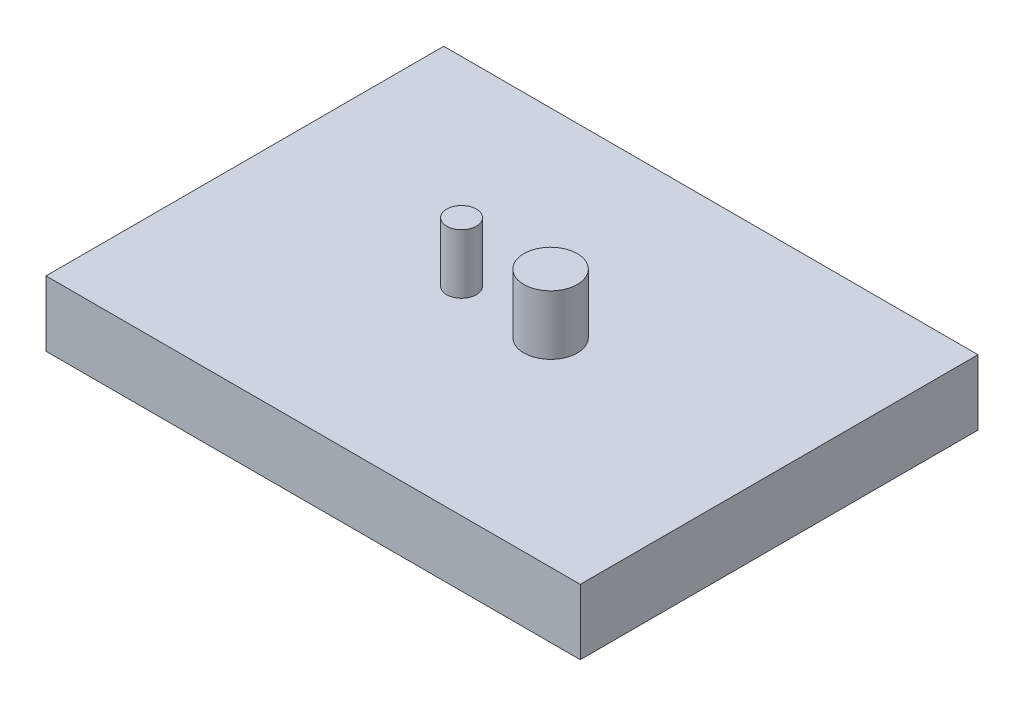
ISO-10303-21;
HEADER;
FILE_DESCRIPTION(('STEP AP214'),'2;1');
FILE_NAME('part.step','',(''),(''),'','','');
FILE_SCHEMA(('AUTOMOTIVE_DESIGN { 1 0 10303 214 1 1 1 1 }'));
ENDSEC;
DATA;
#1=APPLICATION_CONTEXT('core data for automotive mechanical design processes');
#2=APPLICATION_PROTOCOL_DEFINITION('international standard','automotive_design',2000,#1);
#3=PRODUCT_CONTEXT('',#1,'mechanical');
#4=PRODUCT('Part','Part','',(#3));
#5=PRODUCT_RELATED_PRODUCT_CATEGORY('part','',(#4));
#6=PRODUCT_DEFINITION_FORMATION('','',#4);
#7=PRODUCT_DEFINITION_CONTEXT('part definition',#1,'design');
#8=PRODUCT_DEFINITION('design','',#6,#7);
#9=PRODUCT_DEFINITION_SHAPE('','',#8);
#10=(LENGTH_UNIT() NAMED_UNIT(*) SI_UNIT(.MILLI.,.METRE.));
#11=(NAMED_UNIT(*) PLANE_ANGLE_UNIT() SI_UNIT($,.RADIAN.));
#12=(NAMED_UNIT(*) SI_UNIT($,.STERADIAN.) SOLID_ANGLE_UNIT());
#13=UNCERTAINTY_MEASURE_WITH_UNIT(LENGTH_MEASURE(1.E-05),#10,'distance_accuracy_value','');
#14=(GEOMETRIC_REPRESENTATION_CONTEXT(3) GLOBAL_UNCERTAINTY_ASSIGNED_CONTEXT((#13)) GLOBAL_UNIT_ASSIGNED_CONTEXT((#10,
#11,#12)) REPRESENTATION_CONTEXT('',''));
#15=CARTESIAN_POINT('',(0.,0.,0.));
#16=DIRECTION('',(0.,0.,1.));
#17=DIRECTION('',(1.,0.,0.));
#18=AXIS2_PLACEMENT_3D('',#15,#16,#17);
#19=CARTESIAN_POINT('',(0.,11.,0.));
#20=DIRECTION('',(0.,1.,0.));
#21=DIRECTION('',(0.,0.,1.));
#22=AXIS2_PLACEMENT_3D('',#19,#20,#21);
#23=PLANE('',#22);
#24=CARTESIAN_POINT('',(36.5,11.,33.5));
#25=DIRECTION('',(0.,1.,0.));
#26=DIRECTION('',(0.,0.,1.));
#27=AXIS2_PLACEMENT_3D('',#24,#25,#26);
#28=CIRCLE('',#27,2.5);
#29=CARTESIAN_POINT('',(36.5,11.,36.));
#30=VERTEX_POINT('',#29);
#31=EDGE_CURVE('E112',#30,#30,#28,.T.);
#32=ORIENTED_EDGE('',*,*,#31,.F.);
#33=EDGE_LOOP('',(#32));
#34=FACE_BOUND('',#33,.T.);
#35=DIRECTION('',(0.,0.,1.));
#36=VECTOR('',#35,1.);
#37=CARTESIAN_POINT('',(0.,11.,0.));
#38=LINE('',#37,#36);
#39=CARTESIAN_POINT('',(0.,11.,0.));
#40=VERTEX_POINT('',#39);
#41=CARTESIAN_POINT('',(0.,11.,67.));
#42=VERTEX_POINT('',#41);
#43=EDGE_CURVE('E86',#40,#42,#38,.T.);
#44=ORIENTED_EDGE('',*,*,#43,.T.);
#45=DIRECTION('',(1.,0.,0.));
#46=VECTOR('',#45,1.);
#47=CARTESIAN_POINT('',(0.,11.,67.));
#48=LINE('',#47,#46);
#49=CARTESIAN_POINT('',(90.,11.,67.));
#50=VERTEX_POINT('',#49);
#51=EDGE_CURVE('E81',#42,#50,#48,.T.);
#52=ORIENTED_EDGE('',*,*,#51,.T.);
#53=DIRECTION('',(0.,0.,-1.));
#54=VECTOR('',#53,1.);
#55=CARTESIAN_POINT('',(90.,11.,0.));
#56=LINE('',#55,#54);
#57=CARTESIAN_POINT('',(90.,11.,0.));
#58=VERTEX_POINT('',#57);
#59=EDGE_CURVE('E84',#50,#58,#56,.T.);
#60=ORIENTED_EDGE('',*,*,#59,.T.);
#61=DIRECTION('',(-1.,0.,0.));
#62=VECTOR('',#61,1.);
#63=CARTESIAN_POINT('',(0.,11.,0.));
#64=LINE('',#63,#62);
#65=EDGE_CURVE('E51',#58,#40,#64,.T.);
#66=ORIENTED_EDGE('',*,*,#65,.T.);
#67=EDGE_LOOP('',(#44,#52,#60,#66));
#68=FACE_BOUND('',#67,.T.);
#69=CARTESIAN_POINT('',(51.5,11.,33.5));
#70=DIRECTION('',(0.,1.,0.));
#71=DIRECTION('',(0.,0.,1.));
#72=AXIS2_PLACEMENT_3D('',#69,#70,#71);
#73=CIRCLE('',#72,4.5);
#74=CARTESIAN_POINT('',(51.5,11.,38.));
#75=VERTEX_POINT('',#74);
#76=EDGE_CURVE('E118',#75,#75,#73,.T.);
#77=ORIENTED_EDGE('',*,*,#76,.F.);
#78=EDGE_LOOP('',(#77));
#79=FACE_BOUND('',#78,.T.);
#80=ADVANCED_FACE('F34',(#34,#68,#79),#23,.T.);
#81=CARTESIAN_POINT('',(0.,11.,0.));
#82=DIRECTION('',(1.,0.,0.));
#83=DIRECTION('',(0.,0.,-1.));
#84=AXIS2_PLACEMENT_3D('',#81,#82,#83);
#85=PLANE('',#84);
#86=DIRECTION('',(0.,0.,1.));
#87=VECTOR('',#86,1.);
#88=CARTESIAN_POINT('',(0.,0.,0.));
#89=LINE('',#88,#87);
#90=CARTESIAN_POINT('',(0.,0.,0.));
#91=VERTEX_POINT('',#90);
#92=CARTESIAN_POINT('',(0.,0.,67.));
#93=VERTEX_POINT('',#92);
#94=EDGE_CURVE('E98',#91,#93,#89,.T.);
#95=ORIENTED_EDGE('',*,*,#94,.T.);
#96=DIRECTION('',(0.,-1.,0.));
#97=VECTOR('',#96,1.);
#98=CARTESIAN_POINT('',(0.,11.,67.));
#99=LINE('',#98,#97);
#100=EDGE_CURVE('E11',#42,#93,#99,.T.);
#101=ORIENTED_EDGE('',*,*,#100,.F.);
#102=ORIENTED_EDGE('',*,*,#43,.F.);
#103=DIRECTION('',(0.,-1.,0.));
#104=VECTOR('',#103,1.);
#105=CARTESIAN_POINT('',(0.,11.,0.));
#106=LINE('',#105,#104);
#107=EDGE_CURVE('E94',#40,#91,#106,.T.);
#108=ORIENTED_EDGE('',*,*,#107,.T.);
#109=EDGE_LOOP('',(#95,#101,#102,#108));
#110=FACE_BOUND('',#109,.T.);
#111=ADVANCED_FACE('F36',(#110),#85,.F.);
#112=CARTESIAN_POINT('',(0.,11.,67.));
#113=DIRECTION('',(0.,0.,-1.));
#114=DIRECTION('',(-1.,0.,0.));
#115=AXIS2_PLACEMENT_3D('',#112,#113,#114);
#116=PLANE('',#115);
#117=DIRECTION('',(1.,0.,0.));
#118=VECTOR('',#117,1.);
#119=CARTESIAN_POINT('',(0.,0.,67.));
#120=LINE('',#119,#118);
#121=CARTESIAN_POINT('',(90.,0.,67.));
#122=VERTEX_POINT('',#121);
#123=EDGE_CURVE('E90',#93,#122,#120,.T.);
#124=ORIENTED_EDGE('',*,*,#123,.T.);
#125=DIRECTION('',(0.,-1.,0.));
#126=VECTOR('',#125,1.);
#127=CARTESIAN_POINT('',(90.,11.,67.));
#128=LINE('',#127,#126);
#129=EDGE_CURVE('E43',#50,#122,#128,.T.);
#130=ORIENTED_EDGE('',*,*,#129,.F.);
#131=ORIENTED_EDGE('',*,*,#51,.F.);
#132=ORIENTED_EDGE('',*,*,#100,.T.);
#133=EDGE_LOOP('',(#124,#130,#131,#132));
#134=FACE_BOUND('',#133,.T.);
#135=ADVANCED_FACE('F89',(#134),#116,.F.);
#136=CARTESIAN_POINT('',(90.,11.,0.));
#137=DIRECTION('',(-1.,0.,0.));
#138=DIRECTION('',(0.,0.,1.));
#139=AXIS2_PLACEMENT_3D('',#136,#137,#138);
#140=PLANE('',#139);
#141=DIRECTION('',(0.,0.,-1.));
#142=VECTOR('',#141,1.);
#143=CARTESIAN_POINT('',(90.,0.,0.));
#144=LINE('',#143,#142);
#145=CARTESIAN_POINT('',(90.,0.,0.));
#146=VERTEX_POINT('',#145);
#147=EDGE_CURVE('E68',#122,#146,#144,.T.);
#148=ORIENTED_EDGE('',*,*,#147,.T.);
#149=DIRECTION('',(0.,-1.,0.));
#150=VECTOR('',#149,1.);
#151=CARTESIAN_POINT('',(90.,11.,0.));
#152=LINE('',#151,#150);
#153=EDGE_CURVE('E91',#58,#146,#152,.T.);
#154=ORIENTED_EDGE('',*,*,#153,.F.);
#155=ORIENTED_EDGE('',*,*,#59,.F.);
#156=ORIENTED_EDGE('',*,*,#129,.T.);
#157=EDGE_LOOP('',(#148,#154,#155,#156));
#158=FACE_BOUND('',#157,.T.);
#159=ADVANCED_FACE('F92',(#158),#140,.F.);
#160=CARTESIAN_POINT('',(0.,11.,0.));
#161=DIRECTION('',(0.,0.,1.));
#162=DIRECTION('',(1.,0.,0.));
#163=AXIS2_PLACEMENT_3D('',#160,#161,#162);
#164=PLANE('',#163);
#165=DIRECTION('',(-1.,0.,0.));
#166=VECTOR('',#165,1.);
#167=CARTESIAN_POINT('',(0.,0.,0.));
#168=LINE('',#167,#166);
#169=EDGE_CURVE('E74',#146,#91,#168,.T.);
#170=ORIENTED_EDGE('',*,*,#169,.T.);
#171=ORIENTED_EDGE('',*,*,#107,.F.);
#172=ORIENTED_EDGE('',*,*,#65,.F.);
#173=ORIENTED_EDGE('',*,*,#153,.T.);
#174=EDGE_LOOP('',(#170,#171,#172,#173));
#175=FACE_BOUND('',#174,.T.);
#176=ADVANCED_FACE('F106',(#175),#164,.F.);
#177=CARTESIAN_POINT('',(0.,0.,0.));
#178=DIRECTION('',(0.,1.,0.));
#179=DIRECTION('',(0.,0.,1.));
#180=AXIS2_PLACEMENT_3D('',#177,#178,#179);
#181=PLANE('',#180);
#182=ORIENTED_EDGE('',*,*,#94,.F.);
#183=ORIENTED_EDGE('',*,*,#169,.F.);
#184=ORIENTED_EDGE('',*,*,#147,.F.);
#185=ORIENTED_EDGE('',*,*,#123,.F.);
#186=EDGE_LOOP('',(#182,#183,#184,#185));
#187=FACE_BOUND('',#186,.T.);
#188=ADVANCED_FACE('F109',(#187),#181,.F.);
#189=CARTESIAN_POINT('',(36.5,21.,33.5));
#190=DIRECTION('',(0.,-1.,0.));
#191=DIRECTION('',(0.,0.,-1.));
#192=AXIS2_PLACEMENT_3D('',#189,#190,#191);
#193=CYLINDRICAL_SURFACE('',#192,2.5);
#194=CARTESIAN_POINT('',(36.5,21.,33.5));
#195=DIRECTION('',(0.,1.,0.));
#196=DIRECTION('',(0.,0.,1.));
#197=AXIS2_PLACEMENT_3D('',#194,#195,#196);
#198=CIRCLE('',#197,2.5);
#199=CARTESIAN_POINT('',(36.5,21.,36.));
#200=VERTEX_POINT('',#199);
#201=EDGE_CURVE('E101',#200,#200,#198,.T.);
#202=ORIENTED_EDGE('',*,*,#201,.F.);
#203=EDGE_LOOP('',(#202));
#204=FACE_BOUND('',#203,.T.);
#205=ORIENTED_EDGE('',*,*,#31,.T.);
#206=EDGE_LOOP('',(#205));
#207=FACE_BOUND('',#206,.T.);
#208=ADVANCED_FACE('F141',(#204,#207),#193,.T.);
#209=CARTESIAN_POINT('',(36.5,21.,33.5));
#210=DIRECTION('',(0.,1.,0.));
#211=DIRECTION('',(0.,0.,1.));
#212=AXIS2_PLACEMENT_3D('',#209,#210,#211);
#213=PLANE('',#212);
#214=ORIENTED_EDGE('',*,*,#201,.T.);
#215=EDGE_LOOP('',(#214));
#216=FACE_BOUND('',#215,.T.);
#217=ADVANCED_FACE('F129',(#216),#213,.T.);
#218=CARTESIAN_POINT('',(51.5,21.,33.5));
#219=DIRECTION('',(0.,-1.,0.));
#220=DIRECTION('',(0.,0.,-1.));
#221=AXIS2_PLACEMENT_3D('',#218,#219,#220);
#222=CYLINDRICAL_SURFACE('',#221,4.5);
#223=CARTESIAN_POINT('',(51.5,21.,33.5));
#224=DIRECTION('',(0.,1.,0.));
#225=DIRECTION('',(0.,0.,1.));
#226=AXIS2_PLACEMENT_3D('',#223,#224,#225);
#227=CIRCLE('',#226,4.5);
#228=CARTESIAN_POINT('',(51.5,21.,38.));
#229=VERTEX_POINT('',#228);
#230=EDGE_CURVE('E115',#229,#229,#227,.T.);
#231=ORIENTED_EDGE('',*,*,#230,.F.);
#232=EDGE_LOOP('',(#231));
#233=FACE_BOUND('',#232,.T.);
#234=ORIENTED_EDGE('',*,*,#76,.T.);
#235=EDGE_LOOP('',(#234));
#236=FACE_BOUND('',#235,.T.);
#237=ADVANCED_FACE('F126',(#233,#236),#222,.T.);
#238=CARTESIAN_POINT('',(51.5,21.,33.5));
#239=DIRECTION('',(0.,1.,0.));
#240=DIRECTION('',(0.,0.,1.));
#241=AXIS2_PLACEMENT_3D('',#238,#239,#240);
#242=PLANE('',#241);
#243=ORIENTED_EDGE('',*,*,#230,.T.);
#244=EDGE_LOOP('',(#243));
#245=FACE_BOUND('',#244,.T.);
#246=ADVANCED_FACE('F124',(#245),#242,.T.);
#247=CLOSED_SHELL('',(#80,#111,#135,#159,#176,#188,#208,#217,#237,#246));
#248=MANIFOLD_SOLID_BREP('B2',#247);
#249=ADVANCED_BREP_SHAPE_REPRESENTATION('',(#18,#248),#14);
#250=SHAPE_DEFINITION_REPRESENTATION(#9,#249);
ENDSEC;
END-ISO-10303-21;
